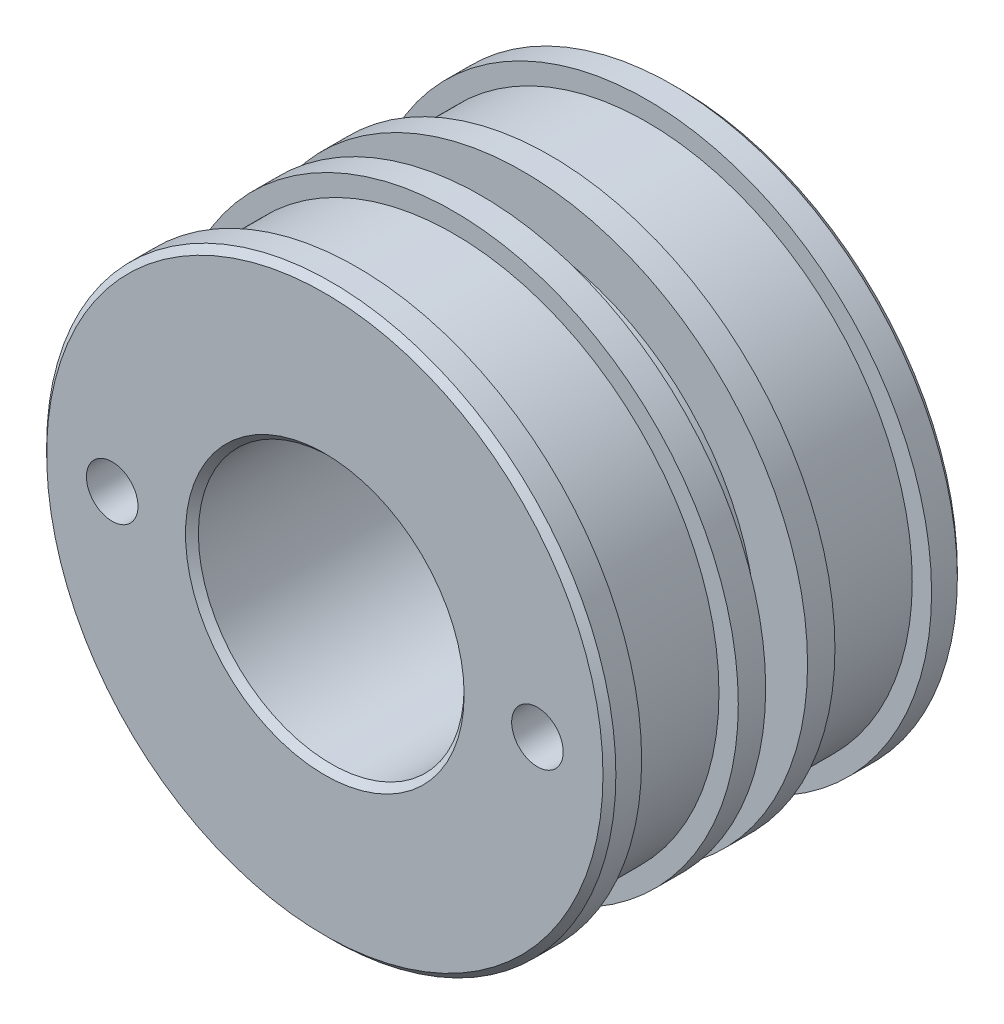
ISO-10303-21;
HEADER;
FILE_DESCRIPTION(('STEP AP214'),'2;1');
FILE_NAME('part.step','',(''),(''),'','','');
FILE_SCHEMA(('AUTOMOTIVE_DESIGN { 1 0 10303 214 1 1 1 1 }'));
ENDSEC;
DATA;
#1=APPLICATION_CONTEXT('core data for automotive mechanical design processes');
#2=APPLICATION_PROTOCOL_DEFINITION('international standard','automotive_design',2000,#1);
#3=PRODUCT_CONTEXT('',#1,'mechanical');
#4=PRODUCT('Part','Part','',(#3));
#5=PRODUCT_RELATED_PRODUCT_CATEGORY('part','',(#4));
#6=PRODUCT_DEFINITION_FORMATION('','',#4);
#7=PRODUCT_DEFINITION_CONTEXT('part definition',#1,'design');
#8=PRODUCT_DEFINITION('design','',#6,#7);
#9=PRODUCT_DEFINITION_SHAPE('','',#8);
#10=(LENGTH_UNIT() NAMED_UNIT(*) SI_UNIT(.MILLI.,.METRE.));
#11=(NAMED_UNIT(*) PLANE_ANGLE_UNIT() SI_UNIT($,.RADIAN.));
#12=(NAMED_UNIT(*) SI_UNIT($,.STERADIAN.) SOLID_ANGLE_UNIT());
#13=UNCERTAINTY_MEASURE_WITH_UNIT(LENGTH_MEASURE(1.E-05),#10,'distance_accuracy_value','');
#14=(GEOMETRIC_REPRESENTATION_CONTEXT(3) GLOBAL_UNCERTAINTY_ASSIGNED_CONTEXT((#13)) GLOBAL_UNIT_ASSIGNED_CONTEXT((#10,
#11,#12)) REPRESENTATION_CONTEXT('',''));
#15=CARTESIAN_POINT('',(0.,0.,0.));
#16=DIRECTION('',(0.,0.,1.));
#17=DIRECTION('',(1.,0.,0.));
#18=AXIS2_PLACEMENT_3D('',#15,#16,#17);
#19=CARTESIAN_POINT('',(0.,0.,-55.));
#20=DIRECTION('',(0.,0.,1.));
#21=DIRECTION('',(1.,0.,0.));
#22=AXIS2_PLACEMENT_3D('',#19,#20,#21);
#23=CYLINDRICAL_SURFACE('',#22,20.625);
#24=CARTESIAN_POINT('',(0.,0.,-1.00000000000002));
#25=DIRECTION('',(0.,0.,1.));
#26=DIRECTION('',(1.,0.,0.));
#27=AXIS2_PLACEMENT_3D('',#24,#25,#26);
#28=CIRCLE('',#27,20.625);
#29=CARTESIAN_POINT('',(20.625,0.,-1.00000000000002));
#30=VERTEX_POINT('',#29);
#31=EDGE_CURVE('E63',#30,#30,#28,.T.);
#32=ORIENTED_EDGE('',*,*,#31,.T.);
#33=EDGE_LOOP('',(#32));
#34=FACE_BOUND('',#33,.T.);
#35=CARTESIAN_POINT('',(0.,0.,-40.));
#36=DIRECTION('',(0.,0.,-1.));
#37=DIRECTION('',(-1.,0.,0.));
#38=AXIS2_PLACEMENT_3D('',#35,#36,#37);
#39=CIRCLE('',#38,20.625);
#40=CARTESIAN_POINT('',(-20.625,0.,-40.));
#41=VERTEX_POINT('',#40);
#42=EDGE_CURVE('E50',#41,#41,#39,.F.);
#43=ORIENTED_EDGE('',*,*,#42,.F.);
#44=EDGE_LOOP('',(#43));
#45=FACE_BOUND('',#44,.T.);
#46=ADVANCED_FACE('F32',(#34,#45),#23,.F.);
#47=CARTESIAN_POINT('',(0.,0.,-55.));
#48=DIRECTION('',(0.,0.,1.));
#49=DIRECTION('',(1.,0.,0.));
#50=AXIS2_PLACEMENT_3D('',#47,#48,#49);
#51=CYLINDRICAL_SURFACE('',#50,44.175);
#52=CARTESIAN_POINT('',(0.,0.,-1.00000000000004));
#53=DIRECTION('',(0.,0.,1.));
#54=DIRECTION('',(1.,0.,0.));
#55=AXIS2_PLACEMENT_3D('',#52,#53,#54);
#56=CIRCLE('',#55,44.175);
#57=CARTESIAN_POINT('',(44.175,0.,-1.00000000000004));
#58=VERTEX_POINT('',#57);
#59=EDGE_CURVE('E43',#58,#58,#56,.F.);
#60=ORIENTED_EDGE('',*,*,#59,.T.);
#61=EDGE_LOOP('',(#60));
#62=FACE_BOUND('',#61,.T.);
#63=CARTESIAN_POINT('',(0.,0.,-5.));
#64=DIRECTION('',(0.,0.,1.));
#65=DIRECTION('',(1.,0.,0.));
#66=AXIS2_PLACEMENT_3D('',#63,#64,#65);
#67=CIRCLE('',#66,44.175);
#68=CARTESIAN_POINT('',(44.175,0.,-5.));
#69=VERTEX_POINT('',#68);
#70=EDGE_CURVE('E85',#69,#69,#67,.T.);
#71=ORIENTED_EDGE('',*,*,#70,.T.);
#72=EDGE_LOOP('',(#71));
#73=FACE_BOUND('',#72,.T.);
#74=ADVANCED_FACE('F157',(#62,#73),#51,.T.);
#75=CARTESIAN_POINT('',(0.,0.,-54.));
#76=DIRECTION('',(0.,0.,1.));
#77=DIRECTION('',(1.,0.,0.));
#78=AXIS2_PLACEMENT_3D('',#75,#76,#77);
#79=CIRCLE('',#78,44.175);
#80=CARTESIAN_POINT('',(44.175,0.,-54.));
#81=VERTEX_POINT('',#80);
#82=EDGE_CURVE('E60',#81,#81,#79,.T.);
#83=ORIENTED_EDGE('',*,*,#82,.T.);
#84=EDGE_LOOP('',(#83));
#85=FACE_BOUND('',#84,.T.);
#86=CARTESIAN_POINT('',(0.,0.,-50.));
#87=DIRECTION('',(0.,0.,1.));
#88=DIRECTION('',(1.,0.,0.));
#89=AXIS2_PLACEMENT_3D('',#86,#87,#88);
#90=CIRCLE('',#89,44.175);
#91=CARTESIAN_POINT('',(44.175,0.,-50.));
#92=VERTEX_POINT('',#91);
#93=EDGE_CURVE('E73',#92,#92,#90,.T.);
#94=ORIENTED_EDGE('',*,*,#93,.F.);
#95=EDGE_LOOP('',(#94));
#96=FACE_BOUND('',#95,.T.);
#97=ADVANCED_FACE('F163',(#85,#96),#51,.T.);
#98=CARTESIAN_POINT('',(0.,0.,-55.));
#99=DIRECTION('',(0.,0.,1.));
#100=DIRECTION('',(1.,0.,0.));
#101=AXIS2_PLACEMENT_3D('',#98,#99,#100);
#102=PLANE('',#101);
#103=CARTESIAN_POINT('',(0.,0.,-55.));
#104=DIRECTION('',(0.,0.,1.));
#105=DIRECTION('',(1.,0.,0.));
#106=AXIS2_PLACEMENT_3D('',#103,#104,#105);
#107=CIRCLE('',#106,25.5);
#108=CARTESIAN_POINT('',(25.5,0.,-55.));
#109=VERTEX_POINT('',#108);
#110=EDGE_CURVE('E10',#109,#109,#107,.T.);
#111=ORIENTED_EDGE('',*,*,#110,.T.);
#112=EDGE_LOOP('',(#111));
#113=FACE_BOUND('',#112,.T.);
#114=CARTESIAN_POINT('',(0.,0.,-55.));
#115=DIRECTION('',(0.,0.,1.));
#116=DIRECTION('',(1.,0.,0.));
#117=AXIS2_PLACEMENT_3D('',#114,#115,#116);
#118=CIRCLE('',#117,43.175);
#119=CARTESIAN_POINT('',(43.175,0.,-55.));
#120=VERTEX_POINT('',#119);
#121=EDGE_CURVE('E66',#120,#120,#118,.F.);
#122=ORIENTED_EDGE('',*,*,#121,.T.);
#123=EDGE_LOOP('',(#122));
#124=FACE_BOUND('',#123,.T.);
#125=ADVANCED_FACE('F132',(#113,#124),#102,.F.);
#126=CARTESIAN_POINT('',(0.,0.,0.));
#127=DIRECTION('',(0.,0.,1.));
#128=DIRECTION('',(1.,0.,0.));
#129=AXIS2_PLACEMENT_3D('',#126,#127,#128);
#130=PLANE('',#129);
#131=CARTESIAN_POINT('',(-33.,0.,0.));
#132=DIRECTION('',(0.,0.,1.));
#133=DIRECTION('',(1.,0.,0.));
#134=AXIS2_PLACEMENT_3D('',#131,#132,#133);
#135=CIRCLE('',#134,4.);
#136=CARTESIAN_POINT('',(-29.,0.,0.));
#137=VERTEX_POINT('',#136);
#138=EDGE_CURVE('E113',#137,#137,#135,.T.);
#139=ORIENTED_EDGE('',*,*,#138,.F.);
#140=EDGE_LOOP('',(#139));
#141=FACE_BOUND('',#140,.T.);
#142=CARTESIAN_POINT('',(33.,0.,0.));
#143=DIRECTION('',(0.,0.,1.));
#144=DIRECTION('',(1.,0.,0.));
#145=AXIS2_PLACEMENT_3D('',#142,#143,#144);
#146=CIRCLE('',#145,4.00000000000001);
#147=CARTESIAN_POINT('',(37.,0.,0.));
#148=VERTEX_POINT('',#147);
#149=EDGE_CURVE('E107',#148,#148,#146,.T.);
#150=ORIENTED_EDGE('',*,*,#149,.F.);
#151=EDGE_LOOP('',(#150));
#152=FACE_BOUND('',#151,.T.);
#153=CARTESIAN_POINT('',(0.,0.,0.));
#154=DIRECTION('',(0.,0.,1.));
#155=DIRECTION('',(1.,0.,0.));
#156=AXIS2_PLACEMENT_3D('',#153,#154,#155);
#157=CIRCLE('',#156,21.625);
#158=CARTESIAN_POINT('',(21.625,0.,0.));
#159=VERTEX_POINT('',#158);
#160=EDGE_CURVE('E47',#159,#159,#157,.F.);
#161=ORIENTED_EDGE('',*,*,#160,.T.);
#162=EDGE_LOOP('',(#161));
#163=FACE_BOUND('',#162,.T.);
#164=CARTESIAN_POINT('',(0.,0.,0.));
#165=DIRECTION('',(0.,0.,1.));
#166=DIRECTION('',(1.,0.,0.));
#167=AXIS2_PLACEMENT_3D('',#164,#165,#166);
#168=CIRCLE('',#167,43.175);
#169=CARTESIAN_POINT('',(43.175,0.,0.));
#170=VERTEX_POINT('',#169);
#171=EDGE_CURVE('E57',#170,#170,#168,.T.);
#172=ORIENTED_EDGE('',*,*,#171,.T.);
#173=EDGE_LOOP('',(#172));
#174=FACE_BOUND('',#173,.T.);
#175=ADVANCED_FACE('F128',(#141,#152,#163,#174),#130,.T.);
#176=CARTESIAN_POINT('',(0.,44.175,-50.));
#177=DIRECTION('',(0.,0.,1.));
#178=DIRECTION('',(1.,0.,0.));
#179=AXIS2_PLACEMENT_3D('',#176,#177,#178);
#180=PLANE('',#179);
#181=ORIENTED_EDGE('',*,*,#93,.T.);
#182=EDGE_LOOP('',(#181));
#183=FACE_BOUND('',#182,.T.);
#184=CARTESIAN_POINT('',(0.,0.,-50.));
#185=DIRECTION('',(0.,0.,1.));
#186=DIRECTION('',(1.,0.,0.));
#187=AXIS2_PLACEMENT_3D('',#184,#185,#186);
#188=CIRCLE('',#187,41.175);
#189=CARTESIAN_POINT('',(41.175,0.,-50.));
#190=VERTEX_POINT('',#189);
#191=EDGE_CURVE('E82',#190,#190,#188,.T.);
#192=ORIENTED_EDGE('',*,*,#191,.F.);
#193=EDGE_LOOP('',(#192));
#194=FACE_BOUND('',#193,.T.);
#195=ADVANCED_FACE('F131',(#183,#194),#180,.T.);
#196=CARTESIAN_POINT('',(0.,0.,0.));
#197=DIRECTION('',(0.,0.,1.));
#198=DIRECTION('',(1.,0.,0.));
#199=AXIS2_PLACEMENT_3D('',#196,#197,#198);
#200=CYLINDRICAL_SURFACE('',#199,41.175);
#201=ORIENTED_EDGE('',*,*,#191,.T.);
#202=EDGE_LOOP('',(#201));
#203=FACE_BOUND('',#202,.T.);
#204=CARTESIAN_POINT('',(0.,0.,-35.));
#205=DIRECTION('',(0.,0.,1.));
#206=DIRECTION('',(1.,0.,0.));
#207=AXIS2_PLACEMENT_3D('',#204,#205,#206);
#208=CIRCLE('',#207,41.175);
#209=CARTESIAN_POINT('',(41.175,0.,-35.));
#210=VERTEX_POINT('',#209);
#211=EDGE_CURVE('E86',#210,#210,#208,.T.);
#212=ORIENTED_EDGE('',*,*,#211,.F.);
#213=EDGE_LOOP('',(#212));
#214=FACE_BOUND('',#213,.T.);
#215=ADVANCED_FACE('F192',(#203,#214),#200,.T.);
#216=CARTESIAN_POINT('',(0.,44.175,-35.));
#217=DIRECTION('',(0.,0.,-1.));
#218=DIRECTION('',(-1.,0.,0.));
#219=AXIS2_PLACEMENT_3D('',#216,#217,#218);
#220=PLANE('',#219);
#221=ORIENTED_EDGE('',*,*,#211,.T.);
#222=EDGE_LOOP('',(#221));
#223=FACE_BOUND('',#222,.T.);
#224=CARTESIAN_POINT('',(0.,0.,-35.));
#225=DIRECTION('',(0.,0.,1.));
#226=DIRECTION('',(1.,0.,0.));
#227=AXIS2_PLACEMENT_3D('',#224,#225,#226);
#228=CIRCLE('',#227,44.175);
#229=CARTESIAN_POINT('',(44.175,0.,-35.));
#230=VERTEX_POINT('',#229);
#231=EDGE_CURVE('E89',#230,#230,#228,.T.);
#232=ORIENTED_EDGE('',*,*,#231,.F.);
#233=EDGE_LOOP('',(#232));
#234=FACE_BOUND('',#233,.T.);
#235=ADVANCED_FACE('F198',(#223,#234),#220,.T.);
#236=CARTESIAN_POINT('',(0.,44.175,-5.));
#237=DIRECTION('',(0.,0.,-1.));
#238=DIRECTION('',(-1.,0.,0.));
#239=AXIS2_PLACEMENT_3D('',#236,#237,#238);
#240=PLANE('',#239);
#241=CARTESIAN_POINT('',(0.,0.,-5.));
#242=DIRECTION('',(0.,0.,1.));
#243=DIRECTION('',(1.,0.,0.));
#244=AXIS2_PLACEMENT_3D('',#241,#242,#243);
#245=CIRCLE('',#244,41.175);
#246=CARTESIAN_POINT('',(41.175,0.,-5.));
#247=VERTEX_POINT('',#246);
#248=EDGE_CURVE('E69',#247,#247,#245,.T.);
#249=ORIENTED_EDGE('',*,*,#248,.T.);
#250=EDGE_LOOP('',(#249));
#251=FACE_BOUND('',#250,.T.);
#252=ORIENTED_EDGE('',*,*,#70,.F.);
#253=EDGE_LOOP('',(#252));
#254=FACE_BOUND('',#253,.T.);
#255=ADVANCED_FACE('F204',(#251,#254),#240,.T.);
#256=CARTESIAN_POINT('',(0.,0.,0.));
#257=DIRECTION('',(0.,0.,1.));
#258=DIRECTION('',(1.,0.,0.));
#259=AXIS2_PLACEMENT_3D('',#256,#257,#258);
#260=CYLINDRICAL_SURFACE('',#259,41.175);
#261=CARTESIAN_POINT('',(0.,0.,-20.));
#262=DIRECTION('',(0.,0.,1.));
#263=DIRECTION('',(1.,0.,0.));
#264=AXIS2_PLACEMENT_3D('',#261,#262,#263);
#265=CIRCLE('',#264,41.175);
#266=CARTESIAN_POINT('',(41.175,0.,-20.));
#267=VERTEX_POINT('',#266);
#268=EDGE_CURVE('E96',#267,#267,#265,.T.);
#269=ORIENTED_EDGE('',*,*,#268,.T.);
#270=EDGE_LOOP('',(#269));
#271=FACE_BOUND('',#270,.T.);
#272=ORIENTED_EDGE('',*,*,#248,.F.);
#273=EDGE_LOOP('',(#272));
#274=FACE_BOUND('',#273,.T.);
#275=ADVANCED_FACE('F217',(#271,#274),#260,.T.);
#276=CARTESIAN_POINT('',(0.,44.175,-20.));
#277=DIRECTION('',(0.,0.,1.));
#278=DIRECTION('',(1.,0.,0.));
#279=AXIS2_PLACEMENT_3D('',#276,#277,#278);
#280=PLANE('',#279);
#281=CARTESIAN_POINT('',(0.,0.,-20.));
#282=DIRECTION('',(0.,0.,1.));
#283=DIRECTION('',(1.,0.,0.));
#284=AXIS2_PLACEMENT_3D('',#281,#282,#283);
#285=CIRCLE('',#284,44.175);
#286=CARTESIAN_POINT('',(44.175,0.,-20.));
#287=VERTEX_POINT('',#286);
#288=EDGE_CURVE('E99',#287,#287,#285,.T.);
#289=ORIENTED_EDGE('',*,*,#288,.T.);
#290=EDGE_LOOP('',(#289));
#291=FACE_BOUND('',#290,.T.);
#292=ORIENTED_EDGE('',*,*,#268,.F.);
#293=EDGE_LOOP('',(#292));
#294=FACE_BOUND('',#293,.T.);
#295=ADVANCED_FACE('F209',(#291,#294),#280,.T.);
#296=CARTESIAN_POINT('',(0.,0.,-30.75));
#297=DIRECTION('',(0.,0.,1.));
#298=DIRECTION('',(1.,0.,0.));
#299=AXIS2_PLACEMENT_3D('',#296,#297,#298);
#300=CIRCLE('',#299,44.175);
#301=CARTESIAN_POINT('',(44.175,0.,-30.75));
#302=VERTEX_POINT('',#301);
#303=EDGE_CURVE('E77',#302,#302,#300,.T.);
#304=ORIENTED_EDGE('',*,*,#303,.F.);
#305=EDGE_LOOP('',(#304));
#306=FACE_BOUND('',#305,.T.);
#307=ORIENTED_EDGE('',*,*,#231,.T.);
#308=EDGE_LOOP('',(#307));
#309=FACE_BOUND('',#308,.T.);
#310=ADVANCED_FACE('F167',(#306,#309),#51,.T.);
#311=CARTESIAN_POINT('',(0.,44.175,-24.25));
#312=DIRECTION('',(0.,0.,-1.));
#313=DIRECTION('',(-1.,0.,0.));
#314=AXIS2_PLACEMENT_3D('',#311,#312,#313);
#315=PLANE('',#314);
#316=CARTESIAN_POINT('',(0.,0.,-24.25));
#317=DIRECTION('',(0.,0.,1.));
#318=DIRECTION('',(1.,0.,0.));
#319=AXIS2_PLACEMENT_3D('',#316,#317,#318);
#320=CIRCLE('',#319,36.175);
#321=CARTESIAN_POINT('',(36.175,0.,-24.25));
#322=VERTEX_POINT('',#321);
#323=EDGE_CURVE('E70',#322,#322,#320,.T.);
#324=ORIENTED_EDGE('',*,*,#323,.T.);
#325=EDGE_LOOP('',(#324));
#326=FACE_BOUND('',#325,.T.);
#327=CARTESIAN_POINT('',(0.,0.,-24.25));
#328=DIRECTION('',(0.,0.,1.));
#329=DIRECTION('',(1.,0.,0.));
#330=AXIS2_PLACEMENT_3D('',#327,#328,#329);
#331=CIRCLE('',#330,44.175);
#332=CARTESIAN_POINT('',(44.175,0.,-24.25));
#333=VERTEX_POINT('',#332);
#334=EDGE_CURVE('E52',#333,#333,#331,.T.);
#335=ORIENTED_EDGE('',*,*,#334,.F.);
#336=EDGE_LOOP('',(#335));
#337=FACE_BOUND('',#336,.T.);
#338=ADVANCED_FACE('F171',(#326,#337),#315,.T.);
#339=CARTESIAN_POINT('',(0.,0.,0.));
#340=DIRECTION('',(0.,0.,1.));
#341=DIRECTION('',(1.,0.,0.));
#342=AXIS2_PLACEMENT_3D('',#339,#340,#341);
#343=CYLINDRICAL_SURFACE('',#342,36.175);
#344=CARTESIAN_POINT('',(0.,0.,-30.75));
#345=DIRECTION('',(0.,0.,1.));
#346=DIRECTION('',(1.,0.,0.));
#347=AXIS2_PLACEMENT_3D('',#344,#345,#346);
#348=CIRCLE('',#347,36.175);
#349=CARTESIAN_POINT('',(36.175,0.,-30.75));
#350=VERTEX_POINT('',#349);
#351=EDGE_CURVE('E74',#350,#350,#348,.T.);
#352=ORIENTED_EDGE('',*,*,#351,.T.);
#353=EDGE_LOOP('',(#352));
#354=FACE_BOUND('',#353,.T.);
#355=ORIENTED_EDGE('',*,*,#323,.F.);
#356=EDGE_LOOP('',(#355));
#357=FACE_BOUND('',#356,.T.);
#358=ADVANCED_FACE('F215',(#354,#357),#343,.T.);
#359=CARTESIAN_POINT('',(0.,44.175,-30.75));
#360=DIRECTION('',(0.,0.,1.));
#361=DIRECTION('',(1.,0.,0.));
#362=AXIS2_PLACEMENT_3D('',#359,#360,#361);
#363=PLANE('',#362);
#364=ORIENTED_EDGE('',*,*,#303,.T.);
#365=EDGE_LOOP('',(#364));
#366=FACE_BOUND('',#365,.T.);
#367=ORIENTED_EDGE('',*,*,#351,.F.);
#368=EDGE_LOOP('',(#367));
#369=FACE_BOUND('',#368,.T.);
#370=ADVANCED_FACE('F180',(#366,#369),#363,.T.);
#371=ORIENTED_EDGE('',*,*,#334,.T.);
#372=EDGE_LOOP('',(#371));
#373=FACE_BOUND('',#372,.T.);
#374=ORIENTED_EDGE('',*,*,#288,.F.);
#375=EDGE_LOOP('',(#374));
#376=FACE_BOUND('',#375,.T.);
#377=ADVANCED_FACE('F166',(#373,#376),#51,.T.);
#378=CARTESIAN_POINT('',(0.,0.,-54.));
#379=DIRECTION('',(0.,0.,1.));
#380=DIRECTION('',(1.,0.,0.));
#381=AXIS2_PLACEMENT_3D('',#378,#379,#380);
#382=CONICAL_SURFACE('',#381,44.175,0.785398163397459);
#383=ORIENTED_EDGE('',*,*,#121,.F.);
#384=EDGE_LOOP('',(#383));
#385=FACE_BOUND('',#384,.T.);
#386=ORIENTED_EDGE('',*,*,#82,.F.);
#387=EDGE_LOOP('',(#386));
#388=FACE_BOUND('',#387,.T.);
#389=ADVANCED_FACE('F152',(#385,#388),#382,.T.);
#390=CARTESIAN_POINT('',(0.,0.,-1.00000000000002));
#391=DIRECTION('',(0.,0.,1.));
#392=DIRECTION('',(1.,0.,0.));
#393=AXIS2_PLACEMENT_3D('',#390,#391,#392);
#394=CONICAL_SURFACE('',#393,20.625,0.785398163397453);
#395=ORIENTED_EDGE('',*,*,#160,.F.);
#396=EDGE_LOOP('',(#395));
#397=FACE_BOUND('',#396,.T.);
#398=ORIENTED_EDGE('',*,*,#31,.F.);
#399=EDGE_LOOP('',(#398));
#400=FACE_BOUND('',#399,.T.);
#401=ADVANCED_FACE('F143',(#397,#400),#394,.F.);
#402=CARTESIAN_POINT('',(0.,0.,0.));
#403=DIRECTION('',(0.,0.,-1.));
#404=DIRECTION('',(-1.,0.,0.));
#405=AXIS2_PLACEMENT_3D('',#402,#403,#404);
#406=CONICAL_SURFACE('',#405,43.175,0.785398163397434);
#407=ORIENTED_EDGE('',*,*,#59,.F.);
#408=EDGE_LOOP('',(#407));
#409=FACE_BOUND('',#408,.T.);
#410=ORIENTED_EDGE('',*,*,#171,.F.);
#411=EDGE_LOOP('',(#410));
#412=FACE_BOUND('',#411,.T.);
#413=ADVANCED_FACE('F140',(#409,#412),#406,.T.);
#414=CARTESIAN_POINT('',(0.,0.,-40.));
#415=DIRECTION('',(0.,0.,-1.));
#416=DIRECTION('',(-1.,0.,0.));
#417=AXIS2_PLACEMENT_3D('',#414,#415,#416);
#418=PLANE('',#417);
#419=CARTESIAN_POINT('',(0.,0.,-40.));
#420=DIRECTION('',(0.,0.,-1.));
#421=DIRECTION('',(-1.,0.,0.));
#422=AXIS2_PLACEMENT_3D('',#419,#420,#421);
#423=CIRCLE('',#422,24.5);
#424=CARTESIAN_POINT('',(-24.5,0.,-40.));
#425=VERTEX_POINT('',#424);
#426=EDGE_CURVE('E53',#425,#425,#423,.T.);
#427=ORIENTED_EDGE('',*,*,#426,.T.);
#428=EDGE_LOOP('',(#427));
#429=FACE_BOUND('',#428,.T.);
#430=ORIENTED_EDGE('',*,*,#42,.T.);
#431=EDGE_LOOP('',(#430));
#432=FACE_BOUND('',#431,.T.);
#433=ADVANCED_FACE('F142',(#429,#432),#418,.T.);
#434=CARTESIAN_POINT('',(0.,0.,-40.));
#435=DIRECTION('',(0.,0.,-1.));
#436=DIRECTION('',(-1.,0.,0.));
#437=AXIS2_PLACEMENT_3D('',#434,#435,#436);
#438=CYLINDRICAL_SURFACE('',#437,24.5);
#439=CARTESIAN_POINT('',(0.,0.,-54.));
#440=DIRECTION('',(0.,0.,1.));
#441=DIRECTION('',(1.,0.,0.));
#442=AXIS2_PLACEMENT_3D('',#439,#440,#441);
#443=CIRCLE('',#442,24.5);
#444=CARTESIAN_POINT('',(24.5,0.,-54.));
#445=VERTEX_POINT('',#444);
#446=EDGE_CURVE('E39',#445,#445,#443,.F.);
#447=ORIENTED_EDGE('',*,*,#446,.T.);
#448=EDGE_LOOP('',(#447));
#449=FACE_BOUND('',#448,.T.);
#450=ORIENTED_EDGE('',*,*,#426,.F.);
#451=EDGE_LOOP('',(#450));
#452=FACE_BOUND('',#451,.T.);
#453=ADVANCED_FACE('F149',(#449,#452),#438,.F.);
#454=CARTESIAN_POINT('',(0.,0.,-54.));
#455=DIRECTION('',(0.,0.,-1.));
#456=DIRECTION('',(-1.,0.,0.));
#457=AXIS2_PLACEMENT_3D('',#454,#455,#456);
#458=CONICAL_SURFACE('',#457,24.5,0.785398163397452);
#459=ORIENTED_EDGE('',*,*,#110,.F.);
#460=EDGE_LOOP('',(#459));
#461=FACE_BOUND('',#460,.T.);
#462=ORIENTED_EDGE('',*,*,#446,.F.);
#463=EDGE_LOOP('',(#462));
#464=FACE_BOUND('',#463,.T.);
#465=ADVANCED_FACE('F34',(#461,#464),#458,.F.);
#466=CARTESIAN_POINT('',(33.,0.,-9.));
#467=DIRECTION('',(0.,0.,1.));
#468=DIRECTION('',(1.,0.,0.));
#469=AXIS2_PLACEMENT_3D('',#466,#467,#468);
#470=CYLINDRICAL_SURFACE('',#469,4.00000000000001);
#471=CARTESIAN_POINT('',(33.,0.,-9.));
#472=DIRECTION('',(0.,0.,1.));
#473=DIRECTION('',(1.,0.,0.));
#474=AXIS2_PLACEMENT_3D('',#471,#472,#473);
#475=CIRCLE('',#474,4.00000000000001);
#476=CARTESIAN_POINT('',(37.,0.,-9.));
#477=VERTEX_POINT('',#476);
#478=EDGE_CURVE('E110',#477,#477,#475,.T.);
#479=ORIENTED_EDGE('',*,*,#478,.F.);
#480=EDGE_LOOP('',(#479));
#481=FACE_BOUND('',#480,.T.);
#482=ORIENTED_EDGE('',*,*,#149,.T.);
#483=EDGE_LOOP('',(#482));
#484=FACE_BOUND('',#483,.T.);
#485=ADVANCED_FACE('F252',(#481,#484),#470,.F.);
#486=CARTESIAN_POINT('',(33.,0.,-9.));
#487=DIRECTION('',(0.,0.,1.));
#488=DIRECTION('',(1.,0.,0.));
#489=AXIS2_PLACEMENT_3D('',#486,#487,#488);
#490=PLANE('',#489);
#491=ORIENTED_EDGE('',*,*,#478,.T.);
#492=EDGE_LOOP('',(#491));
#493=FACE_BOUND('',#492,.T.);
#494=ADVANCED_FACE('F124',(#493),#490,.T.);
#495=CARTESIAN_POINT('',(-33.,0.,-9.));
#496=DIRECTION('',(0.,0.,1.));
#497=DIRECTION('',(1.,0.,0.));
#498=AXIS2_PLACEMENT_3D('',#495,#496,#497);
#499=CYLINDRICAL_SURFACE('',#498,4.);
#500=CARTESIAN_POINT('',(-33.,0.,-9.));
#501=DIRECTION('',(0.,0.,1.));
#502=DIRECTION('',(1.,0.,0.));
#503=AXIS2_PLACEMENT_3D('',#500,#501,#502);
#504=CIRCLE('',#503,4.);
#505=CARTESIAN_POINT('',(-29.,0.,-9.));
#506=VERTEX_POINT('',#505);
#507=EDGE_CURVE('E106',#506,#506,#504,.T.);
#508=ORIENTED_EDGE('',*,*,#507,.F.);
#509=EDGE_LOOP('',(#508));
#510=FACE_BOUND('',#509,.T.);
#511=ORIENTED_EDGE('',*,*,#138,.T.);
#512=EDGE_LOOP('',(#511));
#513=FACE_BOUND('',#512,.T.);
#514=ADVANCED_FACE('F121',(#510,#513),#499,.F.);
#515=CARTESIAN_POINT('',(-33.,0.,-9.));
#516=DIRECTION('',(0.,0.,1.));
#517=DIRECTION('',(1.,0.,0.));
#518=AXIS2_PLACEMENT_3D('',#515,#516,#517);
#519=PLANE('',#518);
#520=ORIENTED_EDGE('',*,*,#507,.T.);
#521=EDGE_LOOP('',(#520));
#522=FACE_BOUND('',#521,.T.);
#523=ADVANCED_FACE('F119',(#522),#519,.T.);
#524=CLOSED_SHELL('',(#46,#74,#97,#125,#175,#195,#215,#235,#255,#275,#295,#310,#338,#358,#370,
#377,#389,#401,#413,#433,#453,#465,#485,#494,#514,#523));
#525=MANIFOLD_SOLID_BREP('B2',#524);
#526=ADVANCED_BREP_SHAPE_REPRESENTATION('',(#18,#525),#14);
#527=SHAPE_DEFINITION_REPRESENTATION(#9,#526);
ENDSEC;
END-ISO-10303-21;
